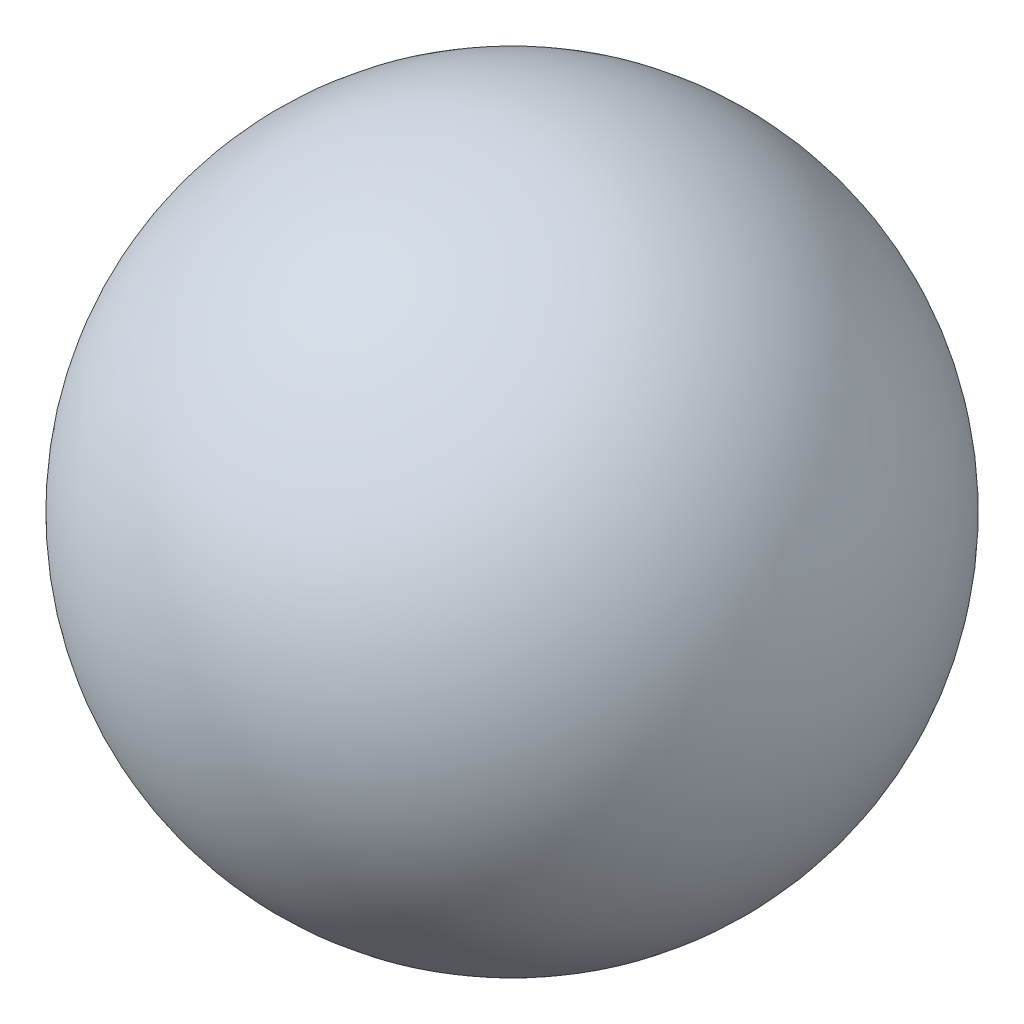
ISO-10303-21;
HEADER;
FILE_DESCRIPTION(('STEP AP214'),'2;1');
FILE_NAME('part.step','',(''),(''),'','','');
FILE_SCHEMA(('AUTOMOTIVE_DESIGN { 1 0 10303 214 1 1 1 1 }'));
ENDSEC;
DATA;
#1=APPLICATION_CONTEXT('core data for automotive mechanical design processes');
#2=APPLICATION_PROTOCOL_DEFINITION('international standard','automotive_design',2000,#1);
#3=PRODUCT_CONTEXT('',#1,'mechanical');
#4=PRODUCT('Part','Part','',(#3));
#5=PRODUCT_RELATED_PRODUCT_CATEGORY('part','',(#4));
#6=PRODUCT_DEFINITION_FORMATION('','',#4);
#7=PRODUCT_DEFINITION_CONTEXT('part definition',#1,'design');
#8=PRODUCT_DEFINITION('design','',#6,#7);
#9=PRODUCT_DEFINITION_SHAPE('','',#8);
#10=(LENGTH_UNIT() NAMED_UNIT(*) SI_UNIT(.MILLI.,.METRE.));
#11=(NAMED_UNIT(*) PLANE_ANGLE_UNIT() SI_UNIT($,.RADIAN.));
#12=(NAMED_UNIT(*) SI_UNIT($,.STERADIAN.) SOLID_ANGLE_UNIT());
#13=UNCERTAINTY_MEASURE_WITH_UNIT(LENGTH_MEASURE(1.E-05),#10,'distance_accuracy_value','');
#14=(GEOMETRIC_REPRESENTATION_CONTEXT(3) GLOBAL_UNCERTAINTY_ASSIGNED_CONTEXT((#13)) GLOBAL_UNIT_ASSIGNED_CONTEXT((#10,
#11,#12)) REPRESENTATION_CONTEXT('',''));
#15=CARTESIAN_POINT('',(0.,0.,0.));
#16=DIRECTION('',(0.,0.,1.));
#17=DIRECTION('',(1.,0.,0.));
#18=AXIS2_PLACEMENT_3D('',#15,#16,#17);
#19=CARTESIAN_POINT('',(0.,0.,0.));
#20=DIRECTION('',(0.,1.,0.));
#21=DIRECTION('',(1.,0.,0.));
#22=AXIS2_PLACEMENT_3D('',#19,#20,#21);
#23=SPHERICAL_SURFACE('',#22,200.025);
#24=CARTESIAN_POINT('',(0.,200.025,0.));
#25=VERTEX_POINT('',#24);
#26=VERTEX_LOOP('',#25);
#27=FACE_BOUND('',#26,.T.);
#28=ADVANCED_FACE('F12',(#27),#23,.T.);
#29=CLOSED_SHELL('',(#28));
#30=MANIFOLD_SOLID_BREP('B1',#29);
#31=ADVANCED_BREP_SHAPE_REPRESENTATION('',(#18,#30),#14);
#32=SHAPE_DEFINITION_REPRESENTATION(#9,#31);
ENDSEC;
END-ISO-10303-21;
